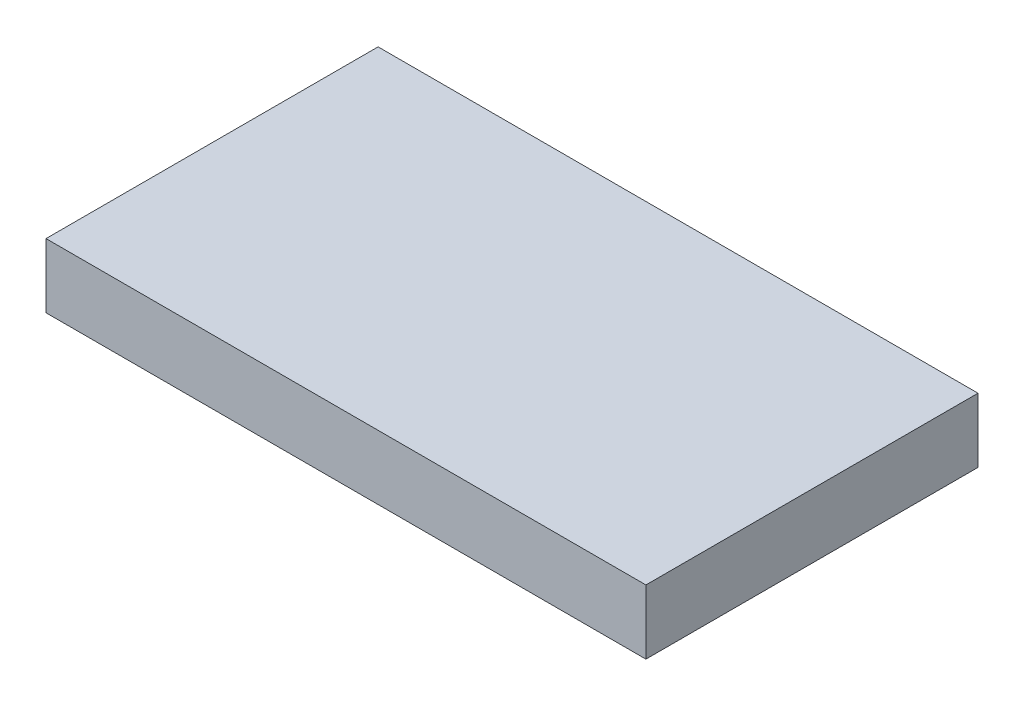
ISO-10303-21;
HEADER;
FILE_DESCRIPTION(('STEP AP214'),'2;1');
FILE_NAME('part.step','',(''),(''),'','','');
FILE_SCHEMA(('AUTOMOTIVE_DESIGN { 1 0 10303 214 1 1 1 1 }'));
ENDSEC;
DATA;
#1=APPLICATION_CONTEXT('core data for automotive mechanical design processes');
#2=APPLICATION_PROTOCOL_DEFINITION('international standard','automotive_design',2000,#1);
#3=PRODUCT_CONTEXT('',#1,'mechanical');
#4=PRODUCT('Part','Part','',(#3));
#5=PRODUCT_RELATED_PRODUCT_CATEGORY('part','',(#4));
#6=PRODUCT_DEFINITION_FORMATION('','',#4);
#7=PRODUCT_DEFINITION_CONTEXT('part definition',#1,'design');
#8=PRODUCT_DEFINITION('design','',#6,#7);
#9=PRODUCT_DEFINITION_SHAPE('','',#8);
#10=(LENGTH_UNIT() NAMED_UNIT(*) SI_UNIT(.MILLI.,.METRE.));
#11=(NAMED_UNIT(*) PLANE_ANGLE_UNIT() SI_UNIT($,.RADIAN.));
#12=(NAMED_UNIT(*) SI_UNIT($,.STERADIAN.) SOLID_ANGLE_UNIT());
#13=UNCERTAINTY_MEASURE_WITH_UNIT(LENGTH_MEASURE(1.E-05),#10,'distance_accuracy_value','');
#14=(GEOMETRIC_REPRESENTATION_CONTEXT(3) GLOBAL_UNCERTAINTY_ASSIGNED_CONTEXT((#13)) GLOBAL_UNIT_ASSIGNED_CONTEXT((#10,
#11,#12)) REPRESENTATION_CONTEXT('',''));
#15=CARTESIAN_POINT('',(0.,0.,0.));
#16=DIRECTION('',(0.,0.,1.));
#17=DIRECTION('',(1.,0.,0.));
#18=AXIS2_PLACEMENT_3D('',#15,#16,#17);
#19=CARTESIAN_POINT('',(0.,6.00000000000001,0.));
#20=DIRECTION('',(0.,1.,0.));
#21=DIRECTION('',(0.,0.,1.));
#22=AXIS2_PLACEMENT_3D('',#19,#20,#21);
#23=PLANE('',#22);
#24=DIRECTION('',(-1.,0.,0.));
#25=VECTOR('',#24,1.);
#26=CARTESIAN_POINT('',(28.,6.00000000000001,-15.5));
#27=LINE('',#26,#25);
#28=CARTESIAN_POINT('',(-28.,6.00000000000001,-15.5));
#29=VERTEX_POINT('',#28);
#30=CARTESIAN_POINT('',(28.,6.00000000000001,-15.5));
#31=VERTEX_POINT('',#30);
#32=EDGE_CURVE('E67',#29,#31,#27,.F.);
#33=ORIENTED_EDGE('',*,*,#32,.F.);
#34=DIRECTION('',(0.,0.,1.));
#35=VECTOR('',#34,1.);
#36=CARTESIAN_POINT('',(-28.,6.00000000000001,-15.5));
#37=LINE('',#36,#35);
#38=CARTESIAN_POINT('',(-28.,6.00000000000001,15.5));
#39=VERTEX_POINT('',#38);
#40=EDGE_CURVE('E19',#39,#29,#37,.F.);
#41=ORIENTED_EDGE('',*,*,#40,.F.);
#42=DIRECTION('',(1.,0.,0.));
#43=VECTOR('',#42,1.);
#44=CARTESIAN_POINT('',(-28.,6.00000000000001,15.5));
#45=LINE('',#44,#43);
#46=CARTESIAN_POINT('',(28.,6.00000000000001,15.5));
#47=VERTEX_POINT('',#46);
#48=EDGE_CURVE('E57',#47,#39,#45,.F.);
#49=ORIENTED_EDGE('',*,*,#48,.F.);
#50=DIRECTION('',(0.,0.,-1.));
#51=VECTOR('',#50,1.);
#52=CARTESIAN_POINT('',(28.,6.00000000000001,15.5));
#53=LINE('',#52,#51);
#54=EDGE_CURVE('E52',#31,#47,#53,.F.);
#55=ORIENTED_EDGE('',*,*,#54,.F.);
#56=EDGE_LOOP('',(#33,#41,#49,#55));
#57=FACE_BOUND('',#56,.T.);
#58=ADVANCED_FACE('F16',(#57),#23,.T.);
#59=CARTESIAN_POINT('',(-28.,0.,-15.5));
#60=DIRECTION('',(-1.,0.,0.));
#61=DIRECTION('',(0.,0.,1.));
#62=AXIS2_PLACEMENT_3D('',#59,#60,#61);
#63=PLANE('',#62);
#64=DIRECTION('',(0.,1.,0.));
#65=VECTOR('',#64,1.);
#66=CARTESIAN_POINT('',(-28.,0.,-15.5));
#67=LINE('',#66,#65);
#68=CARTESIAN_POINT('',(-28.,0.,-15.5));
#69=VERTEX_POINT('',#68);
#70=EDGE_CURVE('E78',#69,#29,#67,.T.);
#71=ORIENTED_EDGE('',*,*,#70,.F.);
#72=DIRECTION('',(0.,0.,1.));
#73=VECTOR('',#72,1.);
#74=CARTESIAN_POINT('',(-28.,0.,0.));
#75=LINE('',#74,#73);
#76=CARTESIAN_POINT('',(-28.,0.,15.5));
#77=VERTEX_POINT('',#76);
#78=EDGE_CURVE('E73',#69,#77,#75,.T.);
#79=ORIENTED_EDGE('',*,*,#78,.T.);
#80=DIRECTION('',(0.,1.,0.));
#81=VECTOR('',#80,1.);
#82=CARTESIAN_POINT('',(-28.,0.,15.5));
#83=LINE('',#82,#81);
#84=EDGE_CURVE('E62',#39,#77,#83,.F.);
#85=ORIENTED_EDGE('',*,*,#84,.F.);
#86=ORIENTED_EDGE('',*,*,#40,.T.);
#87=EDGE_LOOP('',(#71,#79,#85,#86));
#88=FACE_BOUND('',#87,.T.);
#89=ADVANCED_FACE('F72',(#88),#63,.T.);
#90=CARTESIAN_POINT('',(-28.,0.,15.5));
#91=DIRECTION('',(0.,0.,1.));
#92=DIRECTION('',(1.,0.,0.));
#93=AXIS2_PLACEMENT_3D('',#90,#91,#92);
#94=PLANE('',#93);
#95=ORIENTED_EDGE('',*,*,#84,.T.);
#96=DIRECTION('',(1.,0.,0.));
#97=VECTOR('',#96,1.);
#98=CARTESIAN_POINT('',(0.,0.,15.5));
#99=LINE('',#98,#97);
#100=CARTESIAN_POINT('',(28.,0.,15.5));
#101=VERTEX_POINT('',#100);
#102=EDGE_CURVE('E83',#77,#101,#99,.T.);
#103=ORIENTED_EDGE('',*,*,#102,.T.);
#104=DIRECTION('',(0.,1.,0.));
#105=VECTOR('',#104,1.);
#106=CARTESIAN_POINT('',(28.,0.,15.5));
#107=LINE('',#106,#105);
#108=EDGE_CURVE('E64',#47,#101,#107,.F.);
#109=ORIENTED_EDGE('',*,*,#108,.F.);
#110=ORIENTED_EDGE('',*,*,#48,.T.);
#111=EDGE_LOOP('',(#95,#103,#109,#110));
#112=FACE_BOUND('',#111,.T.);
#113=ADVANCED_FACE('F59',(#112),#94,.T.);
#114=CARTESIAN_POINT('',(28.,0.,15.5));
#115=DIRECTION('',(1.,0.,0.));
#116=DIRECTION('',(0.,0.,-1.));
#117=AXIS2_PLACEMENT_3D('',#114,#115,#116);
#118=PLANE('',#117);
#119=ORIENTED_EDGE('',*,*,#108,.T.);
#120=DIRECTION('',(0.,0.,1.));
#121=VECTOR('',#120,1.);
#122=CARTESIAN_POINT('',(28.,0.,0.));
#123=LINE('',#122,#121);
#124=CARTESIAN_POINT('',(28.,0.,-15.5));
#125=VERTEX_POINT('',#124);
#126=EDGE_CURVE('E25',#101,#125,#123,.F.);
#127=ORIENTED_EDGE('',*,*,#126,.T.);
#128=DIRECTION('',(0.,1.,0.));
#129=VECTOR('',#128,1.);
#130=CARTESIAN_POINT('',(28.,0.,-15.5));
#131=LINE('',#130,#129);
#132=EDGE_CURVE('E33',#31,#125,#131,.F.);
#133=ORIENTED_EDGE('',*,*,#132,.F.);
#134=ORIENTED_EDGE('',*,*,#54,.T.);
#135=EDGE_LOOP('',(#119,#127,#133,#134));
#136=FACE_BOUND('',#135,.T.);
#137=ADVANCED_FACE('F87',(#136),#118,.T.);
#138=CARTESIAN_POINT('',(28.,0.,-15.5));
#139=DIRECTION('',(0.,0.,-1.));
#140=DIRECTION('',(-1.,0.,0.));
#141=AXIS2_PLACEMENT_3D('',#138,#139,#140);
#142=PLANE('',#141);
#143=ORIENTED_EDGE('',*,*,#132,.T.);
#144=DIRECTION('',(1.,0.,0.));
#145=VECTOR('',#144,1.);
#146=CARTESIAN_POINT('',(0.,0.,-15.5));
#147=LINE('',#146,#145);
#148=EDGE_CURVE('E11',#125,#69,#147,.F.);
#149=ORIENTED_EDGE('',*,*,#148,.T.);
#150=ORIENTED_EDGE('',*,*,#70,.T.);
#151=ORIENTED_EDGE('',*,*,#32,.T.);
#152=EDGE_LOOP('',(#143,#149,#150,#151));
#153=FACE_BOUND('',#152,.T.);
#154=ADVANCED_FACE('F90',(#153),#142,.T.);
#155=CARTESIAN_POINT('',(0.,0.,0.));
#156=DIRECTION('',(0.,1.,0.));
#157=DIRECTION('',(0.,0.,1.));
#158=AXIS2_PLACEMENT_3D('',#155,#156,#157);
#159=PLANE('',#158);
#160=ORIENTED_EDGE('',*,*,#126,.F.);
#161=ORIENTED_EDGE('',*,*,#102,.F.);
#162=ORIENTED_EDGE('',*,*,#78,.F.);
#163=ORIENTED_EDGE('',*,*,#148,.F.);
#164=EDGE_LOOP('',(#160,#161,#162,#163));
#165=FACE_BOUND('',#164,.T.);
#166=ADVANCED_FACE('F89',(#165),#159,.F.);
#167=CLOSED_SHELL('',(#58,#89,#113,#137,#154,#166));
#168=MANIFOLD_SOLID_BREP('B1',#167);
#169=ADVANCED_BREP_SHAPE_REPRESENTATION('',(#18,#168),#14);
#170=SHAPE_DEFINITION_REPRESENTATION(#9,#169);
ENDSEC;
END-ISO-10303-21;
